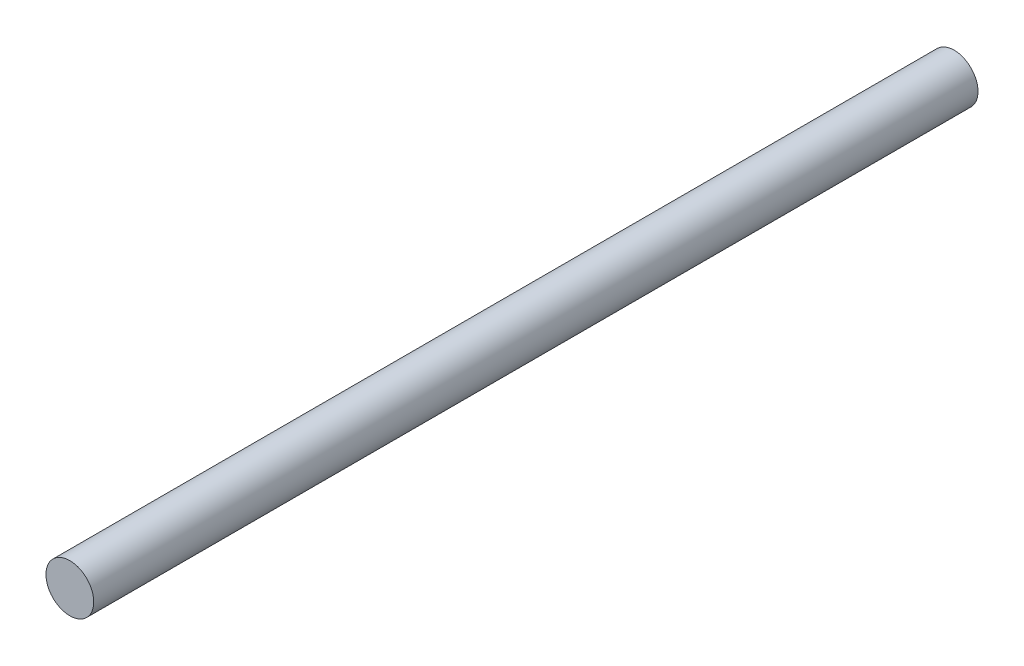
ISO-10303-21;
HEADER;
FILE_DESCRIPTION(('STEP AP214'),'2;1');
FILE_NAME('part.step','',(''),(''),'','','');
FILE_SCHEMA(('AUTOMOTIVE_DESIGN { 1 0 10303 214 1 1 1 1 }'));
ENDSEC;
DATA;
#1=APPLICATION_CONTEXT('core data for automotive mechanical design processes');
#2=APPLICATION_PROTOCOL_DEFINITION('international standard','automotive_design',2000,#1);
#3=PRODUCT_CONTEXT('',#1,'mechanical');
#4=PRODUCT('Part','Part','',(#3));
#5=PRODUCT_RELATED_PRODUCT_CATEGORY('part','',(#4));
#6=PRODUCT_DEFINITION_FORMATION('','',#4);
#7=PRODUCT_DEFINITION_CONTEXT('part definition',#1,'design');
#8=PRODUCT_DEFINITION('design','',#6,#7);
#9=PRODUCT_DEFINITION_SHAPE('','',#8);
#10=(LENGTH_UNIT() NAMED_UNIT(*) SI_UNIT(.MILLI.,.METRE.));
#11=(NAMED_UNIT(*) PLANE_ANGLE_UNIT() SI_UNIT($,.RADIAN.));
#12=(NAMED_UNIT(*) SI_UNIT($,.STERADIAN.) SOLID_ANGLE_UNIT());
#13=UNCERTAINTY_MEASURE_WITH_UNIT(LENGTH_MEASURE(1.E-05),#10,'distance_accuracy_value','');
#14=(GEOMETRIC_REPRESENTATION_CONTEXT(3) GLOBAL_UNCERTAINTY_ASSIGNED_CONTEXT((#13)) GLOBAL_UNIT_ASSIGNED_CONTEXT((#10,
#11,#12)) REPRESENTATION_CONTEXT('',''));
#15=CARTESIAN_POINT('',(0.,0.,0.));
#16=DIRECTION('',(0.,0.,1.));
#17=DIRECTION('',(1.,0.,0.));
#18=AXIS2_PLACEMENT_3D('',#15,#16,#17);
#19=CARTESIAN_POINT('',(0.,0.,74.));
#20=DIRECTION('',(0.,0.,-1.));
#21=DIRECTION('',(-1.,0.,0.));
#22=AXIS2_PLACEMENT_3D('',#19,#20,#21);
#23=CYLINDRICAL_SURFACE('',#22,2.);
#24=CARTESIAN_POINT('',(0.,0.,74.));
#25=DIRECTION('',(0.,0.,1.));
#26=DIRECTION('',(1.,0.,0.));
#27=AXIS2_PLACEMENT_3D('',#24,#25,#26);
#28=CIRCLE('',#27,2.);
#29=CARTESIAN_POINT('',(2.,0.,74.));
#30=VERTEX_POINT('',#29);
#31=EDGE_CURVE('E10',#30,#30,#28,.T.);
#32=ORIENTED_EDGE('',*,*,#31,.F.);
#33=EDGE_LOOP('',(#32));
#34=FACE_BOUND('',#33,.T.);
#35=CARTESIAN_POINT('',(0.,0.,0.));
#36=DIRECTION('',(0.,0.,1.));
#37=DIRECTION('',(1.,0.,0.));
#38=AXIS2_PLACEMENT_3D('',#35,#36,#37);
#39=CIRCLE('',#38,2.);
#40=CARTESIAN_POINT('',(2.,0.,0.));
#41=VERTEX_POINT('',#40);
#42=EDGE_CURVE('E33',#41,#41,#39,.T.);
#43=ORIENTED_EDGE('',*,*,#42,.T.);
#44=EDGE_LOOP('',(#43));
#45=FACE_BOUND('',#44,.T.);
#46=ADVANCED_FACE('F30',(#34,#45),#23,.T.);
#47=CARTESIAN_POINT('',(0.,0.,74.));
#48=DIRECTION('',(0.,0.,1.));
#49=DIRECTION('',(1.,0.,0.));
#50=AXIS2_PLACEMENT_3D('',#47,#48,#49);
#51=PLANE('',#50);
#52=ORIENTED_EDGE('',*,*,#31,.T.);
#53=EDGE_LOOP('',(#52));
#54=FACE_BOUND('',#53,.T.);
#55=ADVANCED_FACE('F45',(#54),#51,.T.);
#56=CARTESIAN_POINT('',(0.,0.,0.));
#57=DIRECTION('',(0.,0.,1.));
#58=DIRECTION('',(1.,0.,0.));
#59=AXIS2_PLACEMENT_3D('',#56,#57,#58);
#60=PLANE('',#59);
#61=ORIENTED_EDGE('',*,*,#42,.F.);
#62=EDGE_LOOP('',(#61));
#63=FACE_BOUND('',#62,.T.);
#64=ADVANCED_FACE('F43',(#63),#60,.F.);
#65=CLOSED_SHELL('',(#46,#55,#64));
#66=MANIFOLD_SOLID_BREP('B2',#65);
#67=ADVANCED_BREP_SHAPE_REPRESENTATION('',(#18,#66),#14);
#68=SHAPE_DEFINITION_REPRESENTATION(#9,#67);
ENDSEC;
END-ISO-10303-21;
